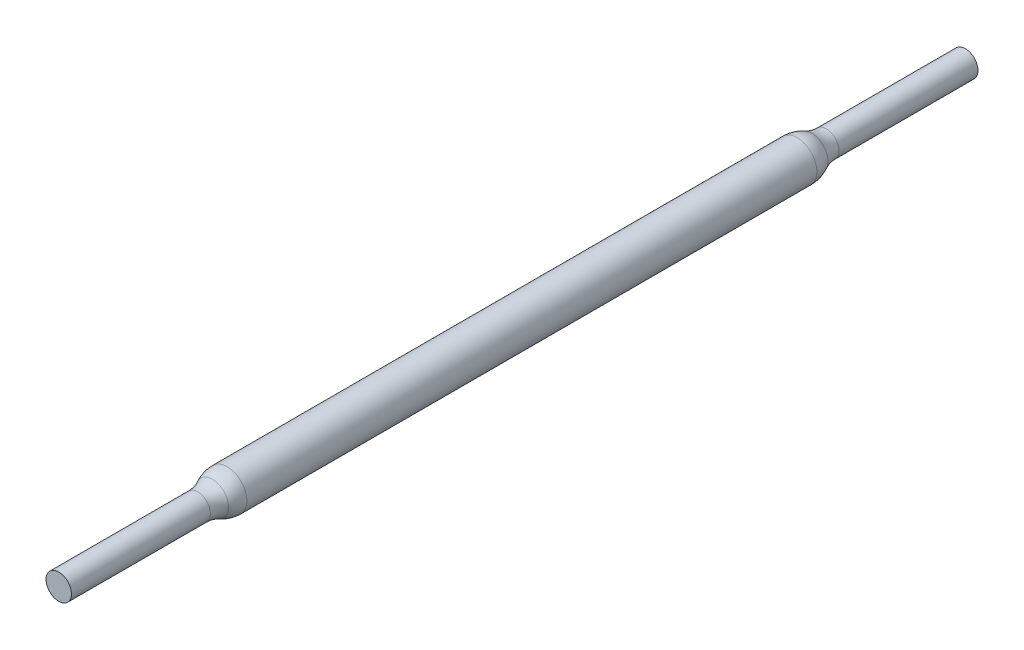
ISO-10303-21;
HEADER;
FILE_DESCRIPTION(('STEP AP214'),'2;1');
FILE_NAME('part.step','',(''),(''),'','','');
FILE_SCHEMA(('AUTOMOTIVE_DESIGN { 1 0 10303 214 1 1 1 1 }'));
ENDSEC;
DATA;
#1=APPLICATION_CONTEXT('core data for automotive mechanical design processes');
#2=APPLICATION_PROTOCOL_DEFINITION('international standard','automotive_design',2000,#1);
#3=PRODUCT_CONTEXT('',#1,'mechanical');
#4=PRODUCT('Part','Part','',(#3));
#5=PRODUCT_RELATED_PRODUCT_CATEGORY('part','',(#4));
#6=PRODUCT_DEFINITION_FORMATION('','',#4);
#7=PRODUCT_DEFINITION_CONTEXT('part definition',#1,'design');
#8=PRODUCT_DEFINITION('design','',#6,#7);
#9=PRODUCT_DEFINITION_SHAPE('','',#8);
#10=(LENGTH_UNIT() NAMED_UNIT(*) SI_UNIT(.MILLI.,.METRE.));
#11=(NAMED_UNIT(*) PLANE_ANGLE_UNIT() SI_UNIT($,.RADIAN.));
#12=(NAMED_UNIT(*) SI_UNIT($,.STERADIAN.) SOLID_ANGLE_UNIT());
#13=UNCERTAINTY_MEASURE_WITH_UNIT(LENGTH_MEASURE(1.E-05),#10,'distance_accuracy_value','');
#14=(GEOMETRIC_REPRESENTATION_CONTEXT(3) GLOBAL_UNCERTAINTY_ASSIGNED_CONTEXT((#13)) GLOBAL_UNIT_ASSIGNED_CONTEXT((#10,
#11,#12)) REPRESENTATION_CONTEXT('',''));
#15=CARTESIAN_POINT('',(0.,0.,0.));
#16=DIRECTION('',(0.,0.,1.));
#17=DIRECTION('',(1.,0.,0.));
#18=AXIS2_PLACEMENT_3D('',#15,#16,#17);
#19=CARTESIAN_POINT('',(0.,0.,50.));
#20=DIRECTION('',(0.,0.,-1.));
#21=DIRECTION('',(-1.,0.,0.));
#22=AXIS2_PLACEMENT_3D('',#19,#20,#21);
#23=CYLINDRICAL_SURFACE('',#22,4.);
#24=CARTESIAN_POINT('',(0.,0.,43.6803876701177));
#25=DIRECTION('',(0.,0.,1.));
#26=DIRECTION('',(1.,0.,0.));
#27=AXIS2_PLACEMENT_3D('',#24,#25,#26);
#28=CIRCLE('',#27,4.);
#29=CARTESIAN_POINT('',(4.,0.,43.6803876701177));
#30=VERTEX_POINT('',#29);
#31=EDGE_CURVE('E69',#30,#30,#28,.F.);
#32=ORIENTED_EDGE('',*,*,#31,.T.);
#33=EDGE_LOOP('',(#32));
#34=FACE_BOUND('',#33,.T.);
#35=CARTESIAN_POINT('',(0.,0.,0.));
#36=DIRECTION('',(0.,0.,1.));
#37=DIRECTION('',(1.,0.,0.));
#38=AXIS2_PLACEMENT_3D('',#35,#36,#37);
#39=CIRCLE('',#38,4.);
#40=CARTESIAN_POINT('',(4.,0.,0.));
#41=VERTEX_POINT('',#40);
#42=EDGE_CURVE('E73',#41,#41,#39,.T.);
#43=ORIENTED_EDGE('',*,*,#42,.T.);
#44=EDGE_LOOP('',(#43));
#45=FACE_BOUND('',#44,.T.);
#46=ADVANCED_FACE('F41',(#34,#45),#23,.T.);
#47=CARTESIAN_POINT('',(0.,0.,0.));
#48=DIRECTION('',(0.,0.,1.));
#49=DIRECTION('',(1.,0.,0.));
#50=AXIS2_PLACEMENT_3D('',#47,#48,#49);
#51=PLANE('',#50);
#52=ORIENTED_EDGE('',*,*,#42,.F.);
#53=EDGE_LOOP('',(#52));
#54=FACE_BOUND('',#53,.T.);
#55=ADVANCED_FACE('F95',(#54),#51,.F.);
#56=CARTESIAN_POINT('',(0.,0.,235.));
#57=DIRECTION('',(0.,0.,-1.));
#58=DIRECTION('',(-1.,0.,0.));
#59=AXIS2_PLACEMENT_3D('',#56,#57,#58);
#60=CYLINDRICAL_SURFACE('',#59,6.25);
#61=CARTESIAN_POINT('',(0.,0.,232.103458034299));
#62=DIRECTION('',(0.,0.,-1.));
#63=DIRECTION('',(-1.,0.,0.));
#64=AXIS2_PLACEMENT_3D('',#61,#62,#63);
#65=CIRCLE('',#64,6.25);
#66=CARTESIAN_POINT('',(-6.25,0.,232.103458034299));
#67=VERTEX_POINT('',#66);
#68=EDGE_CURVE('E49',#67,#67,#65,.T.);
#69=ORIENTED_EDGE('',*,*,#68,.T.);
#70=EDGE_LOOP('',(#69));
#71=FACE_BOUND('',#70,.T.);
#72=CARTESIAN_POINT('',(0.,0.,52.8965419657011));
#73=DIRECTION('',(0.,0.,-1.));
#74=DIRECTION('',(-1.,0.,0.));
#75=AXIS2_PLACEMENT_3D('',#72,#73,#74);
#76=CIRCLE('',#75,6.25);
#77=CARTESIAN_POINT('',(-6.25,0.,52.8965419657011));
#78=VERTEX_POINT('',#77);
#79=EDGE_CURVE('E54',#78,#78,#76,.F.);
#80=ORIENTED_EDGE('',*,*,#79,.T.);
#81=EDGE_LOOP('',(#80));
#82=FACE_BOUND('',#81,.T.);
#83=ADVANCED_FACE('F86',(#71,#82),#60,.T.);
#84=CARTESIAN_POINT('',(0.,0.,285.));
#85=DIRECTION('',(0.,0.,-1.));
#86=DIRECTION('',(-1.,0.,0.));
#87=AXIS2_PLACEMENT_3D('',#84,#85,#86);
#88=CYLINDRICAL_SURFACE('',#87,4.);
#89=CARTESIAN_POINT('',(0.,0.,241.319612329882));
#90=DIRECTION('',(0.,0.,-1.));
#91=DIRECTION('',(-1.,0.,0.));
#92=AXIS2_PLACEMENT_3D('',#89,#90,#91);
#93=CIRCLE('',#92,4.);
#94=CARTESIAN_POINT('',(-4.,0.,241.319612329882));
#95=VERTEX_POINT('',#94);
#96=EDGE_CURVE('E65',#95,#95,#93,.F.);
#97=ORIENTED_EDGE('',*,*,#96,.T.);
#98=EDGE_LOOP('',(#97));
#99=FACE_BOUND('',#98,.T.);
#100=CARTESIAN_POINT('',(0.,0.,285.));
#101=DIRECTION('',(0.,0.,1.));
#102=DIRECTION('',(1.,0.,0.));
#103=AXIS2_PLACEMENT_3D('',#100,#101,#102);
#104=CIRCLE('',#103,4.);
#105=CARTESIAN_POINT('',(4.,0.,285.));
#106=VERTEX_POINT('',#105);
#107=EDGE_CURVE('E77',#106,#106,#104,.T.);
#108=ORIENTED_EDGE('',*,*,#107,.F.);
#109=EDGE_LOOP('',(#108));
#110=FACE_BOUND('',#109,.T.);
#111=ADVANCED_FACE('F84',(#99,#110),#88,.T.);
#112=CARTESIAN_POINT('',(0.,0.,285.));
#113=DIRECTION('',(0.,0.,1.));
#114=DIRECTION('',(1.,0.,0.));
#115=AXIS2_PLACEMENT_3D('',#112,#113,#114);
#116=PLANE('',#115);
#117=ORIENTED_EDGE('',*,*,#107,.T.);
#118=EDGE_LOOP('',(#117));
#119=FACE_BOUND('',#118,.T.);
#120=ADVANCED_FACE('F82',(#119),#116,.T.);
#121=CARTESIAN_POINT('',(0.,0.,43.6803876701177));
#122=DIRECTION('',(0.,0.,1.));
#123=DIRECTION('',(1.,0.,0.));
#124=AXIS2_PLACEMENT_3D('',#121,#122,#123);
#125=TOROIDAL_SURFACE('',#124,14.,10.);
#126=CARTESIAN_POINT('',(0.,0.,48.2884648179094));
#127=DIRECTION('',(0.,0.,-1.));
#128=DIRECTION('',(-1.,0.,0.));
#129=AXIS2_PLACEMENT_3D('',#126,#127,#128);
#130=CIRCLE('',#129,5.125);
#131=CARTESIAN_POINT('',(-5.125,0.,48.2884648179094));
#132=VERTEX_POINT('',#131);
#133=EDGE_CURVE('E10',#132,#132,#130,.T.);
#134=ORIENTED_EDGE('',*,*,#133,.T.);
#135=EDGE_LOOP('',(#134));
#136=FACE_BOUND('',#135,.T.);
#137=ORIENTED_EDGE('',*,*,#31,.F.);
#138=EDGE_LOOP('',(#137));
#139=FACE_BOUND('',#138,.T.);
#140=ADVANCED_FACE('F93',(#136,#139),#125,.F.);
#141=CARTESIAN_POINT('',(0.,0.,241.319612329882));
#142=DIRECTION('',(0.,0.,-1.));
#143=DIRECTION('',(-1.,0.,0.));
#144=AXIS2_PLACEMENT_3D('',#141,#142,#143);
#145=TOROIDAL_SURFACE('',#144,14.,10.);
#146=CARTESIAN_POINT('',(0.,0.,236.711535182091));
#147=DIRECTION('',(0.,0.,1.));
#148=DIRECTION('',(1.,0.,0.));
#149=AXIS2_PLACEMENT_3D('',#146,#147,#148);
#150=CIRCLE('',#149,5.125);
#151=CARTESIAN_POINT('',(5.125,0.,236.711535182091));
#152=VERTEX_POINT('',#151);
#153=EDGE_CURVE('E59',#152,#152,#150,.T.);
#154=ORIENTED_EDGE('',*,*,#153,.T.);
#155=EDGE_LOOP('',(#154));
#156=FACE_BOUND('',#155,.T.);
#157=ORIENTED_EDGE('',*,*,#96,.F.);
#158=EDGE_LOOP('',(#157));
#159=FACE_BOUND('',#158,.T.);
#160=ADVANCED_FACE('F109',(#156,#159),#145,.F.);
#161=CARTESIAN_POINT('',(0.,0.,232.103458034299));
#162=DIRECTION('',(0.,0.,-1.));
#163=DIRECTION('',(-1.,0.,0.));
#164=AXIS2_PLACEMENT_3D('',#161,#162,#163);
#165=DEGENERATE_TOROIDAL_SURFACE('',#164,3.75,10.,.F.);
#166=ORIENTED_EDGE('',*,*,#68,.F.);
#167=EDGE_LOOP('',(#166));
#168=FACE_BOUND('',#167,.T.);
#169=ORIENTED_EDGE('',*,*,#153,.F.);
#170=EDGE_LOOP('',(#169));
#171=FACE_BOUND('',#170,.T.);
#172=ADVANCED_FACE('F111',(#168,#171),#165,.F.);
#173=CARTESIAN_POINT('',(0.,0.,52.8965419657011));
#174=DIRECTION('',(0.,0.,-1.));
#175=DIRECTION('',(-1.,0.,0.));
#176=AXIS2_PLACEMENT_3D('',#173,#174,#175);
#177=DEGENERATE_TOROIDAL_SURFACE('',#176,3.75,10.,.F.);
#178=ORIENTED_EDGE('',*,*,#133,.F.);
#179=EDGE_LOOP('',(#178));
#180=FACE_BOUND('',#179,.T.);
#181=ORIENTED_EDGE('',*,*,#79,.F.);
#182=EDGE_LOOP('',(#181));
#183=FACE_BOUND('',#182,.T.);
#184=ADVANCED_FACE('F43',(#180,#183),#177,.F.);
#185=CLOSED_SHELL('',(#46,#55,#83,#111,#120,#140,#160,#172,#184));
#186=MANIFOLD_SOLID_BREP('B2',#185);
#187=ADVANCED_BREP_SHAPE_REPRESENTATION('',(#18,#186),#14);
#188=SHAPE_DEFINITION_REPRESENTATION(#9,#187);
ENDSEC;
END-ISO-10303-21;
